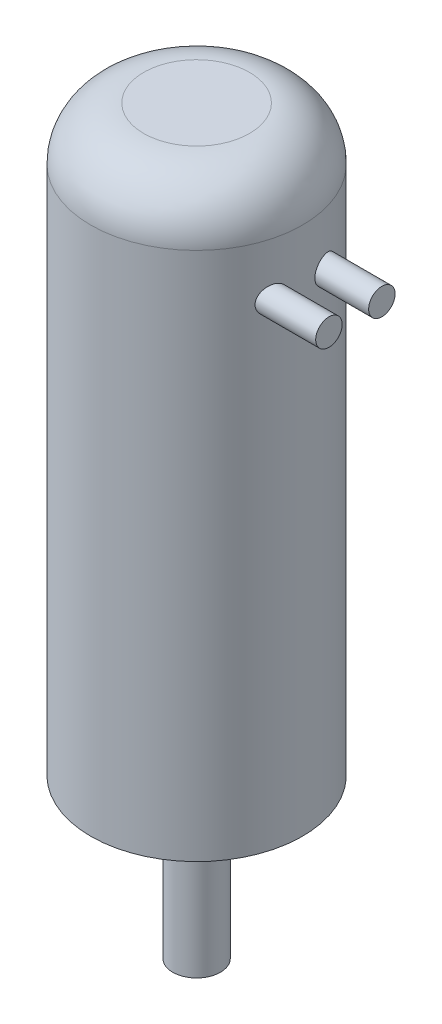
ISO-10303-21;
HEADER;
FILE_DESCRIPTION(('STEP AP214'),'2;1');
FILE_NAME('part.step','',(''),(''),'','','');
FILE_SCHEMA(('AUTOMOTIVE_DESIGN { 1 0 10303 214 1 1 1 1 }'));
ENDSEC;
DATA;
#1=APPLICATION_CONTEXT('core data for automotive mechanical design processes');
#2=APPLICATION_PROTOCOL_DEFINITION('international standard','automotive_design',2000,#1);
#3=PRODUCT_CONTEXT('',#1,'mechanical');
#4=PRODUCT('Part','Part','',(#3));
#5=PRODUCT_RELATED_PRODUCT_CATEGORY('part','',(#4));
#6=PRODUCT_DEFINITION_FORMATION('','',#4);
#7=PRODUCT_DEFINITION_CONTEXT('part definition',#1,'design');
#8=PRODUCT_DEFINITION('design','',#6,#7);
#9=PRODUCT_DEFINITION_SHAPE('','',#8);
#10=(LENGTH_UNIT() NAMED_UNIT(*) SI_UNIT(.MILLI.,.METRE.));
#11=(NAMED_UNIT(*) PLANE_ANGLE_UNIT() SI_UNIT($,.RADIAN.));
#12=(NAMED_UNIT(*) SI_UNIT($,.STERADIAN.) SOLID_ANGLE_UNIT());
#13=UNCERTAINTY_MEASURE_WITH_UNIT(LENGTH_MEASURE(1.E-05),#10,'distance_accuracy_value','');
#14=(GEOMETRIC_REPRESENTATION_CONTEXT(3) GLOBAL_UNCERTAINTY_ASSIGNED_CONTEXT((#13)) GLOBAL_UNIT_ASSIGNED_CONTEXT((#10,
#11,#12)) REPRESENTATION_CONTEXT('',''));
#15=CARTESIAN_POINT('',(0.,0.,0.));
#16=DIRECTION('',(0.,0.,1.));
#17=DIRECTION('',(1.,0.,0.));
#18=AXIS2_PLACEMENT_3D('',#15,#16,#17);
#19=CARTESIAN_POINT('',(0.,110.,0.));
#20=DIRECTION('',(0.,-1.,0.));
#21=DIRECTION('',(0.,0.,-1.));
#22=AXIS2_PLACEMENT_3D('',#19,#20,#21);
#23=CYLINDRICAL_SURFACE('',#22,20.);
#24=CARTESIAN_POINT('',(19.8431348329844,90.,2.50000000000031));
#25=CARTESIAN_POINT('',(19.843135344229,90.1393793903155,2.50000587026509));
#26=CARTESIAN_POINT('',(19.8416722223921,90.278846752808,2.51169505177883));
#27=CARTESIAN_POINT('',(19.83573620239,90.5539232794833,2.55814327399725));
#28=CARTESIAN_POINT('',(19.8312601463048,90.6895282398058,2.59292651955594));
#29=CARTESIAN_POINT('',(19.8190684909682,90.9528743081882,2.68451973471324));
#30=CARTESIAN_POINT('',(19.8113543070866,91.0806188240726,2.74132007991511));
#31=CARTESIAN_POINT('',(19.7923631733213,91.3246482679433,2.87522349667774));
#32=CARTESIAN_POINT('',(19.7810870437219,91.4409358262842,2.95232189309756));
#33=CARTESIAN_POINT('',(19.7546127496897,91.6589207724978,3.12455574368754));
#34=CARTESIAN_POINT('',(19.7394115070427,91.7606066113419,3.21970533864754));
#35=CARTESIAN_POINT('',(19.7048086966353,91.9465076751619,3.42510410536916));
#36=CARTESIAN_POINT('',(19.6854069849542,92.0307223013278,3.53535379445776));
#37=CARTESIAN_POINT('',(19.6421472627648,92.1799500324165,3.76830810318437));
#38=CARTESIAN_POINT('',(19.6182635921912,92.2448467100948,3.89108248329845));
#39=CARTESIAN_POINT('',(19.5662150823004,92.3532552326303,4.14487614103723));
#40=CARTESIAN_POINT('',(19.5380499436628,92.3967655814536,4.27589599473306));
#41=CARTESIAN_POINT('',(19.4772670200013,92.462174377879,4.54482096621953));
#42=CARTESIAN_POINT('',(19.4445786331882,92.4836725436973,4.68280730156269));
#43=CARTESIAN_POINT('',(19.3758292080499,92.5035234989594,4.95959566882768));
#44=CARTESIAN_POINT('',(19.3397676333792,92.5018726014072,5.09839782716811));
#45=CARTESIAN_POINT('',(19.264081809966,92.4754371438161,5.37742324007169));
#46=CARTESIAN_POINT('',(19.2243820512694,92.4499418211575,5.51755864932562));
#47=CARTESIAN_POINT('',(19.143735738183,92.3757401945999,5.79117856153424));
#48=CARTESIAN_POINT('',(19.1027889286413,92.3270291103845,5.92466168847391));
#49=CARTESIAN_POINT('',(19.0200686782914,92.2060354942766,6.18515838630004));
#50=CARTESIAN_POINT('',(18.9783040470179,92.1331332484722,6.31188756016971));
#51=CARTESIAN_POINT('',(18.8970215951835,91.9659614014418,6.55122666235532));
#52=CARTESIAN_POINT('',(18.8575039691166,91.8716899540726,6.66383536945952));
#53=CARTESIAN_POINT('',(18.7829914006659,91.664492942433,6.87104949823758));
#54=CARTESIAN_POINT('',(18.747976153291,91.5516567647227,6.96573672669024));
#55=CARTESIAN_POINT('',(18.6844167670453,91.3098580195144,7.13447462815925));
#56=CARTESIAN_POINT('',(18.6558703560298,91.1809011391002,7.20853254921293));
#57=CARTESIAN_POINT('',(18.6085513033315,90.9175906273232,7.32979224772536));
#58=CARTESIAN_POINT('',(18.5893474666785,90.7838667368445,7.37819070991202));
#59=CARTESIAN_POINT('',(18.5600018938643,90.5092287422077,7.45170619458158));
#60=CARTESIAN_POINT('',(18.5498556115403,90.3683182827165,7.4768348968468));
#61=CARTESIAN_POINT('',(18.5397617867143,90.0932228787908,7.50182603394595));
#62=CARTESIAN_POINT('',(18.5391922056344,89.9591987264147,7.50322953399005));
#63=CARTESIAN_POINT('',(18.5466999338661,89.6929018667931,7.48465238168099));
#64=CARTESIAN_POINT('',(18.5547760453895,89.5606289195025,7.46467469151249));
#65=CARTESIAN_POINT('',(18.5787459933225,89.3044098701205,7.40480890189028));
#66=CARTESIAN_POINT('',(18.5944715406399,89.1803470486059,7.36534914376644));
#67=CARTESIAN_POINT('',(18.6326667013466,88.9407153032011,7.26818010688173));
#68=CARTESIAN_POINT('',(18.6551373348601,88.8251476674129,7.21046806758238));
#69=CARTESIAN_POINT('',(18.7065432834526,88.6008050405387,7.07605801685678));
#70=CARTESIAN_POINT('',(18.7356974399572,88.4924737559201,6.99870457576093));
#71=CARTESIAN_POINT('',(18.7983626128655,88.2901136052442,6.82859942568972));
#72=CARTESIAN_POINT('',(18.8318749388658,88.196089056755,6.73584308593219));
#73=CARTESIAN_POINT('',(18.9039873905953,88.0185589746392,6.53083465934623));
#74=CARTESIAN_POINT('',(18.9427769285921,87.9361437936672,6.4177042033679));
#75=CARTESIAN_POINT('',(19.0217613494536,87.7914273921718,6.17966986165371));
#76=CARTESIAN_POINT('',(19.0619566022754,87.7291315114881,6.05476286166484));
#77=CARTESIAN_POINT('',(19.1439256291271,87.623827628148,5.79051453038635));
#78=CARTESIAN_POINT('',(19.1856902115539,87.5817992963356,5.65077848666123));
#79=CARTESIAN_POINT('',(19.2673884627621,87.5225943726874,5.36560660404853));
#80=CARTESIAN_POINT('',(19.307322069748,87.5054186190278,5.22017057309352));
#81=CARTESIAN_POINT('',(19.3840234743854,87.4967691625277,4.92772477474633));
#82=CARTESIAN_POINT('',(19.4207921489987,87.505288316227,4.78071545606814));
#83=CARTESIAN_POINT('',(19.4901662570728,87.5482535882032,4.48952272444257));
#84=CARTESIAN_POINT('',(19.5227724028574,87.5826952634448,4.34533883157116));
#85=CARTESIAN_POINT('',(19.5822762154416,87.6755134464214,4.06864889756143));
#86=CARTESIAN_POINT('',(19.6093157158878,87.7331414326314,3.93592234707889));
#87=CARTESIAN_POINT('',(19.6586253891034,87.870897453448,3.68174142780296));
#88=CARTESIAN_POINT('',(19.6808965315167,87.9510209059355,3.56028477013263));
#89=CARTESIAN_POINT('',(19.7201281355356,88.1288764670624,3.33603779600606));
#90=CARTESIAN_POINT('',(19.7372267809057,88.2260143519546,3.23279993291143));
#91=CARTESIAN_POINT('',(19.7672355163134,88.4367216233858,3.0439395567116));
#92=CARTESIAN_POINT('',(19.7801450559489,88.5502931662937,2.9583193589134));
#93=CARTESIAN_POINT('',(19.8019646301426,88.7887915135031,2.80853363330959));
#94=CARTESIAN_POINT('',(19.8109303250316,88.9135282436881,2.74407301685597));
#95=CARTESIAN_POINT('',(19.8254781412002,89.1721031138184,2.63692354424186));
#96=CARTESIAN_POINT('',(19.8310639248404,89.3059312270489,2.59421113043022));
#97=CARTESIAN_POINT('',(19.8377987820228,89.5337115145031,2.5420777888962));
#98=CARTESIAN_POINT('',(19.8398038192762,89.6262397278627,2.52632109239416));
#99=CARTESIAN_POINT('',(19.8424716721192,89.8124986888831,2.50528022843794));
#100=CARTESIAN_POINT('',(19.8431344890333,89.9062294353572,2.49999605064998));
#101=CARTESIAN_POINT('',(19.8431348329844,90.,2.50000000000031));
#102=B_SPLINE_CURVE_WITH_KNOTS('',3,(#24,#25,#26,#27,#28,#29,#30,#31,#32,#33,#34,#35,#36,#37,
#38,#39,#40,#41,#42,#43,#44,#45,#46,#47,#48,#49,#50,#51,#52,#53,#54,#55,#56,#57,#58,#59,#60,#61,
#62,#63,#64,#65,#66,#67,#68,#69,#70,#71,#72,#73,#74,#75,#76,#77,#78,#79,#80,#81,#82,#83,#84,#85,
#86,#87,#88,#89,#90,#91,#92,#93,#94,#95,#96,#97,#98,#99,#100,#101),.UNSPECIFIED.,.T.,.F.,(4,2,2,
2,2,2,2,2,2,2,2,2,2,2,2,2,2,2,2,2,2,2,2,2,2,2,2,2,2,2,2,2,2,2,2,2,2,2,4),(0.,0.417797216195898,
0.836033017748188,1.25408620050934,1.67204317943929,2.09032893602092,2.50862902659667,
2.92940137006008,3.35020314354672,3.77852796228928,4.20692100192537,4.64850504895588,
5.0901800610852,5.54417754589606,5.99821426774077,6.4501256207928,6.90187799547468,
7.33012939009972,7.75816571595972,8.15828380130084,8.55834646081047,8.94998057096449,
9.34167394157231,9.74871795980041,10.1558845754841,10.5896843674093,11.0235991991886,
11.4767882661478,11.9299926169704,12.3830709837291,12.8360717120177,13.2754914949287,
13.7148218369374,14.1410928623632,14.567419872439,14.9875202303987,15.4071645624289,
15.6882471488738,15.9693294579596),.UNSPECIFIED.);
#103=CARTESIAN_POINT('',(19.8431348329844,90.,2.50000000000031));
#104=VERTEX_POINT('',#103);
#105=EDGE_CURVE('E246',#104,#104,#102,.T.);
#106=ORIENTED_EDGE('',*,*,#105,.F.);
#107=EDGE_LOOP('',(#106));
#108=FACE_BOUND('',#107,.T.);
#109=CARTESIAN_POINT('',(18.5404962177393,90.,-7.49999999999969));
#110=CARTESIAN_POINT('',(18.5405002445042,90.1336056619152,-7.49999324384551));
#111=CARTESIAN_POINT('',(18.5448597217072,90.2673000132087,-7.48924089508543));
#112=CARTESIAN_POINT('',(18.5620019286141,90.5308147875287,-7.44664938334086));
#113=CARTESIAN_POINT('',(18.5747940217122,90.6606307363731,-7.41478677978742));
#114=CARTESIAN_POINT('',(18.60789035293,90.9123817583636,-7.3313307696184));
#115=CARTESIAN_POINT('',(18.6281772879972,91.0343342298564,-7.2797828006863));
#116=CARTESIAN_POINT('',(18.6750088222164,91.2676422300549,-7.15878728183652));
#117=CARTESIAN_POINT('',(18.7015532718023,91.3789980119518,-7.08934015973787));
#118=CARTESIAN_POINT('',(18.7605170044856,91.5925653328781,-6.93183305573649));
#119=CARTESIAN_POINT('',(18.7931159499546,91.6942921385604,-6.84318417885233));
#120=CARTESIAN_POINT('',(18.8618300034328,91.8816775915512,-6.65144605866163));
#121=CARTESIAN_POINT('',(18.8979461597781,91.9673314257648,-6.54835250594887));
#122=CARTESIAN_POINT('',(18.9744775625873,92.1257913503454,-6.32330521024957));
#123=CARTESIAN_POINT('',(19.0150199981116,92.1974228182885,-6.20056632313904));
#124=CARTESIAN_POINT('',(19.0965111899097,92.3189008492571,-5.94485217535916));
#125=CARTESIAN_POINT('',(19.1374600345213,92.368742565054,-5.8118746447874));
#126=CARTESIAN_POINT('',(19.2194656857657,92.4465016262426,-5.5347666045585));
#127=CARTESIAN_POINT('',(19.2604854515492,92.4736808256584,-5.39041693722654));
#128=CARTESIAN_POINT('',(19.3398217098457,92.5023628943521,-5.09844797024061));
#129=CARTESIAN_POINT('',(19.3781383465336,92.5038671340697,-4.95082884551998));
#130=CARTESIAN_POINT('',(19.4504695154551,92.4808475058643,-4.65850073255228));
#131=CARTESIAN_POINT('',(19.4845314725415,92.4566459250908,-4.51377834989423));
#132=CARTESIAN_POINT('',(19.5481267059628,92.3829419266664,-4.229881954762));
#133=CARTESIAN_POINT('',(19.577660839767,92.3334443072367,-4.09070689545153));
#134=CARTESIAN_POINT('',(19.6309097256083,92.212271697519,-3.8268692589836));
#135=CARTESIAN_POINT('',(19.6547833889482,92.1413761299813,-3.7018806667704));
#136=CARTESIAN_POINT('',(19.6978598109644,91.9787607232489,-3.46536937721258));
#137=CARTESIAN_POINT('',(19.7170632515602,91.8870439280378,-3.35384471514017));
#138=CARTESIAN_POINT('',(19.750554586205,91.6879743175387,-3.1505497771019));
#139=CARTESIAN_POINT('',(19.7649557856257,91.5810821636099,-3.05834668998989));
#140=CARTESIAN_POINT('',(19.7898256802309,91.353011720263,-2.89306181652361));
#141=CARTESIAN_POINT('',(19.8002946276491,91.2318343478236,-2.81997880380624));
#142=CARTESIAN_POINT('',(19.8175705337347,90.9800721180683,-2.69588559780876));
#143=CARTESIAN_POINT('',(19.8244160529086,90.8496038088389,-2.64464415794474));
#144=CARTESIAN_POINT('',(19.8349259685011,90.5818272356888,-2.56463510663255));
#145=CARTESIAN_POINT('',(19.8385904173892,90.4445190846261,-2.53586712450121));
#146=CARTESIAN_POINT('',(19.8429270702952,90.1673191952236,-2.50170866655308));
#147=CARTESIAN_POINT('',(19.8436065165568,90.0274345378432,-2.49626161008999));
#148=CARTESIAN_POINT('',(19.8420312805149,89.7487297801568,-2.50875114393292));
#149=CARTESIAN_POINT('',(19.8397766105395,89.6099096753803,-2.52668763599092));
#150=CARTESIAN_POINT('',(19.8322098310389,89.3373024843343,-2.58540506495597));
#151=CARTESIAN_POINT('',(19.8268983079534,89.2035144379365,-2.626181620088));
#152=CARTESIAN_POINT('',(19.8129581956072,88.9447395458504,-2.72935536558421));
#153=CARTESIAN_POINT('',(19.8043296443439,88.8197525993625,-2.79175230828034));
#154=CARTESIAN_POINT('',(19.7834123022126,88.5820671304402,-2.936309105388));
#155=CARTESIAN_POINT('',(19.7711222818549,88.469372753137,-3.01847559645693));
#156=CARTESIAN_POINT('',(19.7425438247678,88.2594607063159,-3.20006047220524));
#157=CARTESIAN_POINT('',(19.7262554261808,88.1622428891745,-3.29947869230975));
#158=CARTESIAN_POINT('',(19.6893693882971,87.9856046518816,-3.512901248064));
#159=CARTESIAN_POINT('',(19.6687575689384,87.9062446230096,-3.62695308920499));
#160=CARTESIAN_POINT('',(19.6231838217256,87.7677433824336,-3.86593298769674));
#161=CARTESIAN_POINT('',(19.598221725507,87.7086029535316,-3.99086146590167));
#162=CARTESIAN_POINT('',(19.543766346014,87.6112330764459,-4.24957372860542));
#163=CARTESIAN_POINT('',(19.5142191902053,87.573280765972,-4.38345033914552));
#164=CARTESIAN_POINT('',(19.4512883335531,87.52009532002,-4.65475874329112));
#165=CARTESIAN_POINT('',(19.4179041222964,87.5048652108729,-4.79219100798867));
#166=CARTESIAN_POINT('',(19.3471000157508,87.4970166636558,-5.07059096360583));
#167=CARTESIAN_POINT('',(19.3095958219613,87.5050164103043,-5.21155448931222));
#168=CARTESIAN_POINT('',(19.2324066770238,87.5443850507613,-5.48956897395256));
#169=CARTESIAN_POINT('',(19.1927213001556,87.57575852173,-5.62661916109811));
#170=CARTESIAN_POINT('',(19.111222695389,87.6622313366778,-5.89761158328311));
#171=CARTESIAN_POINT('',(19.0693820204928,87.7180581194898,-6.03131383991512));
#172=CARTESIAN_POINT('',(18.986515405017,87.852049103313,-6.28731721825613));
#173=CARTESIAN_POINT('',(18.9454895775557,87.9302163828052,-6.40961676560946));
#174=CARTESIAN_POINT('',(18.865758397104,88.1079835761054,-6.64065252508321));
#175=CARTESIAN_POINT('',(18.8270822305641,88.2078017674796,-6.74923132678126));
#176=CARTESIAN_POINT('',(18.7546768344048,88.4260096433354,-6.947899233612));
#177=CARTESIAN_POINT('',(18.7209478871635,88.5444003871055,-7.03798728344476));
#178=CARTESIAN_POINT('',(18.6617039412225,88.7921597113934,-7.19357445133337));
#179=CARTESIAN_POINT('',(18.6359413634987,88.9209943885469,-7.25982822565013));
#180=CARTESIAN_POINT('',(18.5929206520612,89.1892879599714,-7.36931504604926));
#181=CARTESIAN_POINT('',(18.5756476456602,89.3287277767278,-7.41258836186108));
#182=CARTESIAN_POINT('',(18.5557604469357,89.5577851254704,-7.46218020777656));
#183=CARTESIAN_POINT('',(18.5500544449537,89.6455170631091,-7.47633490400744));
#184=CARTESIAN_POINT('',(18.5424210847354,89.8221529381697,-7.4952468133914));
#185=CARTESIAN_POINT('',(18.5404935370648,89.911056816611,-7.50000449766731));
#186=CARTESIAN_POINT('',(18.5404962177393,90.,-7.49999999999969));
#187=B_SPLINE_CURVE_WITH_KNOTS('',3,(#109,#110,#111,#112,#113,#114,#115,#116,#117,#118,#119,
#120,#121,#122,#123,#124,#125,#126,#127,#128,#129,#130,#131,#132,#133,#134,#135,#136,#137,#138,
#139,#140,#141,#142,#143,#144,#145,#146,#147,#148,#149,#150,#151,#152,#153,#154,#155,#156,#157,
#158,#159,#160,#161,#162,#163,#164,#165,#166,#167,#168,#169,#170,#171,#172,#173,#174,#175,#176,
#177,#178,#179,#180,#181,#182,#183,#184,#185,#186),.UNSPECIFIED.,.T.,.F.,(4,2,2,2,2,2,2,2,2,2,2,
2,2,2,2,2,2,2,2,2,2,2,2,2,2,2,2,2,2,2,2,2,2,2,2,2,2,2,4),(0.,0.40047759242033,0.801400617213097,
1.20140377237562,1.60139736769523,2.01605121951068,2.43082904308503,2.87217927028076,
3.31362762792465,3.76894766186254,4.22424339233265,4.67389748642116,5.12346632054209,
5.55831134090549,5.99309282949012,6.41673810167286,6.84035619454825,7.25937058658683,
7.67837806714491,8.09636838410016,8.5143569448381,8.93226534358915,9.35016895523212,
9.76821305376238,10.1862531645317,10.6056864346777,11.0251359413459,11.4499504285405,
11.8748214909993,12.3111018216128,12.7474676093,13.1978038801268,13.6482022364435,
14.1033719574817,14.5585676486428,14.9977217736019,15.4361037875453,15.7027207660485,
15.9693243772671),.UNSPECIFIED.);
#188=CARTESIAN_POINT('',(18.5404962177393,90.,-7.49999999999969));
#189=VERTEX_POINT('',#188);
#190=EDGE_CURVE('E70',#189,#189,#187,.T.);
#191=ORIENTED_EDGE('',*,*,#190,.F.);
#192=EDGE_LOOP('',(#191));
#193=FACE_BOUND('',#192,.T.);
#194=CARTESIAN_POINT('',(0.,100.,0.));
#195=DIRECTION('',(0.,1.,0.));
#196=DIRECTION('',(0.,0.,1.));
#197=AXIS2_PLACEMENT_3D('',#194,#195,#196);
#198=CIRCLE('',#197,20.);
#199=CARTESIAN_POINT('',(0.,100.,20.));
#200=VERTEX_POINT('',#199);
#201=EDGE_CURVE('E10',#200,#200,#198,.F.);
#202=ORIENTED_EDGE('',*,*,#201,.T.);
#203=EDGE_LOOP('',(#202));
#204=FACE_BOUND('',#203,.T.);
#205=CARTESIAN_POINT('',(0.,0.,0.));
#206=DIRECTION('',(0.,1.,0.));
#207=DIRECTION('',(0.,0.,1.));
#208=AXIS2_PLACEMENT_3D('',#205,#206,#207);
#209=CIRCLE('',#208,20.);
#210=CARTESIAN_POINT('',(0.,0.,20.));
#211=VERTEX_POINT('',#210);
#212=EDGE_CURVE('E48',#211,#211,#209,.T.);
#213=ORIENTED_EDGE('',*,*,#212,.T.);
#214=EDGE_LOOP('',(#213));
#215=FACE_BOUND('',#214,.T.);
#216=ADVANCED_FACE('F37',(#108,#193,#204,#215),#23,.T.);
#217=CARTESIAN_POINT('',(0.,110.,0.));
#218=DIRECTION('',(0.,1.,0.));
#219=DIRECTION('',(0.,0.,1.));
#220=AXIS2_PLACEMENT_3D('',#217,#218,#219);
#221=PLANE('',#220);
#222=CARTESIAN_POINT('',(0.,110.,0.));
#223=DIRECTION('',(0.,1.,0.));
#224=DIRECTION('',(0.,0.,1.));
#225=AXIS2_PLACEMENT_3D('',#222,#223,#224);
#226=CIRCLE('',#225,10.);
#227=CARTESIAN_POINT('',(0.,110.,10.));
#228=VERTEX_POINT('',#227);
#229=EDGE_CURVE('E44',#228,#228,#226,.T.);
#230=ORIENTED_EDGE('',*,*,#229,.T.);
#231=EDGE_LOOP('',(#230));
#232=FACE_BOUND('',#231,.T.);
#233=ADVANCED_FACE('F103',(#232),#221,.T.);
#234=CARTESIAN_POINT('',(0.,0.,0.));
#235=DIRECTION('',(0.,1.,0.));
#236=DIRECTION('',(0.,0.,1.));
#237=AXIS2_PLACEMENT_3D('',#234,#235,#236);
#238=PLANE('',#237);
#239=CARTESIAN_POINT('',(0.,0.,0.));
#240=DIRECTION('',(0.,1.,0.));
#241=DIRECTION('',(0.,0.,1.));
#242=AXIS2_PLACEMENT_3D('',#239,#240,#241);
#243=CIRCLE('',#242,4.5);
#244=CARTESIAN_POINT('',(0.,0.,4.5));
#245=VERTEX_POINT('',#244);
#246=EDGE_CURVE('E67',#245,#245,#243,.T.);
#247=ORIENTED_EDGE('',*,*,#246,.T.);
#248=EDGE_LOOP('',(#247));
#249=FACE_BOUND('',#248,.T.);
#250=CARTESIAN_POINT('',(15.,0.,0.));
#251=DIRECTION('',(0.,1.,0.));
#252=DIRECTION('',(0.,0.,1.));
#253=AXIS2_PLACEMENT_3D('',#250,#251,#252);
#254=CIRCLE('',#253,3.);
#255=CARTESIAN_POINT('',(15.,0.,3.));
#256=VERTEX_POINT('',#255);
#257=EDGE_CURVE('E62',#256,#256,#254,.T.);
#258=ORIENTED_EDGE('',*,*,#257,.T.);
#259=EDGE_LOOP('',(#258));
#260=FACE_BOUND('',#259,.T.);
#261=CARTESIAN_POINT('',(-15.,0.,1.04744440165294E-13));
#262=DIRECTION('',(0.,1.,0.));
#263=DIRECTION('',(0.,0.,1.));
#264=AXIS2_PLACEMENT_3D('',#261,#262,#263);
#265=CIRCLE('',#264,3.);
#266=CARTESIAN_POINT('',(-15.,0.,3.00000000000011));
#267=VERTEX_POINT('',#266);
#268=EDGE_CURVE('E55',#267,#267,#265,.T.);
#269=ORIENTED_EDGE('',*,*,#268,.T.);
#270=EDGE_LOOP('',(#269));
#271=FACE_BOUND('',#270,.T.);
#272=ORIENTED_EDGE('',*,*,#212,.F.);
#273=EDGE_LOOP('',(#272));
#274=FACE_BOUND('',#273,.T.);
#275=ADVANCED_FACE('F109',(#249,#260,#271,#274),#238,.F.);
#276=CARTESIAN_POINT('',(-15.,25.,1.04744440165294E-13));
#277=DIRECTION('',(0.,-1.,0.));
#278=DIRECTION('',(0.,0.,-1.));
#279=AXIS2_PLACEMENT_3D('',#276,#277,#278);
#280=CYLINDRICAL_SURFACE('',#279,3.);
#281=CARTESIAN_POINT('',(-15.,25.,1.04744440165294E-13));
#282=DIRECTION('',(0.,1.,0.));
#283=DIRECTION('',(0.,0.,1.));
#284=AXIS2_PLACEMENT_3D('',#281,#282,#283);
#285=CIRCLE('',#284,3.);
#286=CARTESIAN_POINT('',(-15.,25.,3.00000000000011));
#287=VERTEX_POINT('',#286);
#288=EDGE_CURVE('E58',#287,#287,#285,.T.);
#289=ORIENTED_EDGE('',*,*,#288,.T.);
#290=EDGE_LOOP('',(#289));
#291=FACE_BOUND('',#290,.T.);
#292=ORIENTED_EDGE('',*,*,#268,.F.);
#293=EDGE_LOOP('',(#292));
#294=FACE_BOUND('',#293,.T.);
#295=ADVANCED_FACE('F115',(#291,#294),#280,.F.);
#296=CARTESIAN_POINT('',(-15.,25.,1.04744440165294E-13));
#297=DIRECTION('',(0.,1.,0.));
#298=DIRECTION('',(0.,0.,1.));
#299=AXIS2_PLACEMENT_3D('',#296,#297,#298);
#300=PLANE('',#299);
#301=ORIENTED_EDGE('',*,*,#288,.F.);
#302=EDGE_LOOP('',(#301));
#303=FACE_BOUND('',#302,.T.);
#304=ADVANCED_FACE('F120',(#303),#300,.F.);
#305=CARTESIAN_POINT('',(15.,25.,0.));
#306=DIRECTION('',(0.,-1.,0.));
#307=DIRECTION('',(0.,0.,-1.));
#308=AXIS2_PLACEMENT_3D('',#305,#306,#307);
#309=CYLINDRICAL_SURFACE('',#308,3.);
#310=CARTESIAN_POINT('',(15.,25.,0.));
#311=DIRECTION('',(0.,1.,0.));
#312=DIRECTION('',(0.,0.,1.));
#313=AXIS2_PLACEMENT_3D('',#310,#311,#312);
#314=CIRCLE('',#313,3.);
#315=CARTESIAN_POINT('',(15.,25.,3.));
#316=VERTEX_POINT('',#315);
#317=EDGE_CURVE('E52',#316,#316,#314,.T.);
#318=ORIENTED_EDGE('',*,*,#317,.T.);
#319=EDGE_LOOP('',(#318));
#320=FACE_BOUND('',#319,.T.);
#321=ORIENTED_EDGE('',*,*,#257,.F.);
#322=EDGE_LOOP('',(#321));
#323=FACE_BOUND('',#322,.T.);
#324=ADVANCED_FACE('F124',(#320,#323),#309,.F.);
#325=CARTESIAN_POINT('',(15.,25.,0.));
#326=DIRECTION('',(0.,1.,0.));
#327=DIRECTION('',(0.,0.,1.));
#328=AXIS2_PLACEMENT_3D('',#325,#326,#327);
#329=PLANE('',#328);
#330=ORIENTED_EDGE('',*,*,#317,.F.);
#331=EDGE_LOOP('',(#330));
#332=FACE_BOUND('',#331,.T.);
#333=ADVANCED_FACE('F128',(#332),#329,.F.);
#334=CARTESIAN_POINT('',(0.,-30.,0.));
#335=DIRECTION('',(0.,1.,0.));
#336=DIRECTION('',(0.,0.,1.));
#337=AXIS2_PLACEMENT_3D('',#334,#335,#336);
#338=CYLINDRICAL_SURFACE('',#337,4.5);
#339=CARTESIAN_POINT('',(0.,-30.,0.));
#340=DIRECTION('',(0.,1.,0.));
#341=DIRECTION('',(0.,0.,1.));
#342=AXIS2_PLACEMENT_3D('',#339,#340,#341);
#343=CIRCLE('',#342,4.5);
#344=CARTESIAN_POINT('',(0.,-30.,4.5));
#345=VERTEX_POINT('',#344);
#346=EDGE_CURVE('E59',#345,#345,#343,.T.);
#347=ORIENTED_EDGE('',*,*,#346,.T.);
#348=EDGE_LOOP('',(#347));
#349=FACE_BOUND('',#348,.T.);
#350=ORIENTED_EDGE('',*,*,#246,.F.);
#351=EDGE_LOOP('',(#350));
#352=FACE_BOUND('',#351,.T.);
#353=ADVANCED_FACE('F132',(#349,#352),#338,.T.);
#354=CARTESIAN_POINT('',(0.,-30.,0.));
#355=DIRECTION('',(0.,1.,0.));
#356=DIRECTION('',(0.,0.,1.));
#357=AXIS2_PLACEMENT_3D('',#354,#355,#356);
#358=PLANE('',#357);
#359=ORIENTED_EDGE('',*,*,#346,.F.);
#360=EDGE_LOOP('',(#359));
#361=FACE_BOUND('',#360,.T.);
#362=ADVANCED_FACE('F99',(#361),#358,.F.);
#363=CARTESIAN_POINT('',(0.,100.,0.));
#364=DIRECTION('',(0.,1.,0.));
#365=DIRECTION('',(0.,0.,1.));
#366=AXIS2_PLACEMENT_3D('',#363,#364,#365);
#367=DEGENERATE_TOROIDAL_SURFACE('',#366,10.,10.,.T.);
#368=ORIENTED_EDGE('',*,*,#201,.F.);
#369=EDGE_LOOP('',(#368));
#370=FACE_BOUND('',#369,.T.);
#371=ORIENTED_EDGE('',*,*,#229,.F.);
#372=EDGE_LOOP('',(#371));
#373=FACE_BOUND('',#372,.T.);
#374=ADVANCED_FACE('F39',(#370,#373),#367,.T.);
#375=CARTESIAN_POINT('',(30.,90.,-4.99999999999969));
#376=DIRECTION('',(1.,0.,0.));
#377=DIRECTION('',(0.,0.,-1.));
#378=AXIS2_PLACEMENT_3D('',#375,#376,#377);
#379=PLANE('',#378);
#380=CARTESIAN_POINT('',(30.,90.,-4.99999999999969));
#381=DIRECTION('',(1.,0.,0.));
#382=DIRECTION('',(0.,0.,-1.));
#383=AXIS2_PLACEMENT_3D('',#380,#381,#382);
#384=CIRCLE('',#383,2.5);
#385=CARTESIAN_POINT('',(30.,90.,-7.49999999999969));
#386=VERTEX_POINT('',#385);
#387=EDGE_CURVE('E79',#386,#386,#384,.T.);
#388=ORIENTED_EDGE('',*,*,#387,.T.);
#389=EDGE_LOOP('',(#388));
#390=FACE_BOUND('',#389,.T.);
#391=ADVANCED_FACE('F90',(#390),#379,.T.);
#392=CARTESIAN_POINT('',(-20.001,90.,-4.99999999999969));
#393=DIRECTION('',(1.,0.,0.));
#394=DIRECTION('',(0.,0.,-1.));
#395=AXIS2_PLACEMENT_3D('',#392,#393,#394);
#396=CYLINDRICAL_SURFACE('',#395,2.5);
#397=ORIENTED_EDGE('',*,*,#387,.F.);
#398=EDGE_LOOP('',(#397));
#399=FACE_BOUND('',#398,.T.);
#400=ORIENTED_EDGE('',*,*,#190,.T.);
#401=EDGE_LOOP('',(#400));
#402=FACE_BOUND('',#401,.T.);
#403=ADVANCED_FACE('F81',(#399,#402),#396,.T.);
#404=CARTESIAN_POINT('',(30.,90.,5.00000000000031));
#405=DIRECTION('',(1.,0.,0.));
#406=DIRECTION('',(0.,0.,-1.));
#407=AXIS2_PLACEMENT_3D('',#404,#405,#406);
#408=PLANE('',#407);
#409=CARTESIAN_POINT('',(30.,90.,5.00000000000031));
#410=DIRECTION('',(1.,0.,0.));
#411=DIRECTION('',(0.,0.,-1.));
#412=AXIS2_PLACEMENT_3D('',#409,#410,#411);
#413=CIRCLE('',#412,2.5);
#414=CARTESIAN_POINT('',(30.,90.,2.50000000000031));
#415=VERTEX_POINT('',#414);
#416=EDGE_CURVE('E244',#415,#415,#413,.T.);
#417=ORIENTED_EDGE('',*,*,#416,.T.);
#418=EDGE_LOOP('',(#417));
#419=FACE_BOUND('',#418,.T.);
#420=ADVANCED_FACE('F97',(#419),#408,.T.);
#421=CARTESIAN_POINT('',(-20.001,90.,5.00000000000031));
#422=DIRECTION('',(1.,0.,0.));
#423=DIRECTION('',(0.,0.,-1.));
#424=AXIS2_PLACEMENT_3D('',#421,#422,#423);
#425=CYLINDRICAL_SURFACE('',#424,2.5);
#426=ORIENTED_EDGE('',*,*,#416,.F.);
#427=EDGE_LOOP('',(#426));
#428=FACE_BOUND('',#427,.T.);
#429=ORIENTED_EDGE('',*,*,#105,.T.);
#430=EDGE_LOOP('',(#429));
#431=FACE_BOUND('',#430,.T.);
#432=ADVANCED_FACE('F87',(#428,#431),#425,.T.);
#433=CLOSED_SHELL('',(#216,#233,#275,#295,#304,#324,#333,#353,#362,#374,#391,#403,#420,#432));
#434=MANIFOLD_SOLID_BREP('B2',#433);
#435=ADVANCED_BREP_SHAPE_REPRESENTATION('',(#18,#434),#14);
#436=SHAPE_DEFINITION_REPRESENTATION(#9,#435);
ENDSEC;
END-ISO-10303-21;
